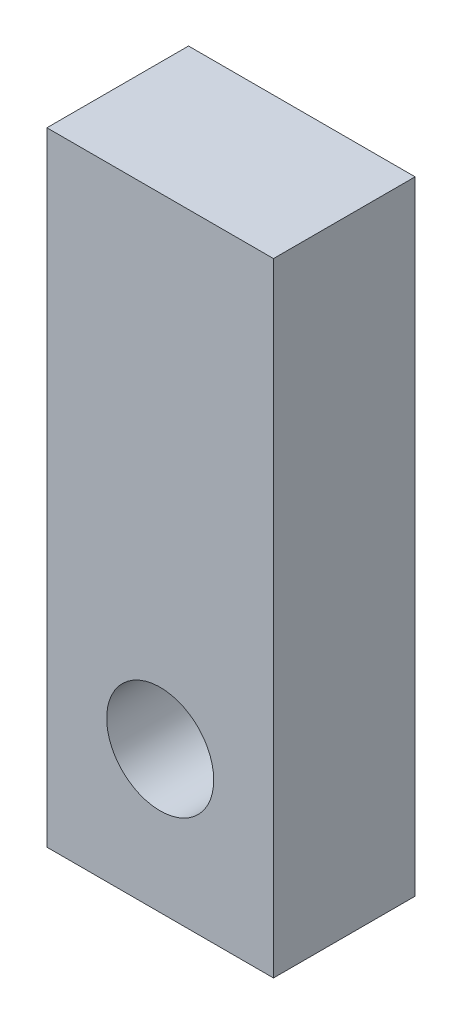
ISO-10303-21;
HEADER;
FILE_DESCRIPTION(('STEP AP214'),'2;1');
FILE_NAME('part.step','',(''),(''),'','','');
FILE_SCHEMA(('AUTOMOTIVE_DESIGN { 1 0 10303 214 1 1 1 1 }'));
ENDSEC;
DATA;
#1=APPLICATION_CONTEXT('core data for automotive mechanical design processes');
#2=APPLICATION_PROTOCOL_DEFINITION('international standard','automotive_design',2000,#1);
#3=PRODUCT_CONTEXT('',#1,'mechanical');
#4=PRODUCT('Part','Part','',(#3));
#5=PRODUCT_RELATED_PRODUCT_CATEGORY('part','',(#4));
#6=PRODUCT_DEFINITION_FORMATION('','',#4);
#7=PRODUCT_DEFINITION_CONTEXT('part definition',#1,'design');
#8=PRODUCT_DEFINITION('design','',#6,#7);
#9=PRODUCT_DEFINITION_SHAPE('','',#8);
#10=(LENGTH_UNIT() NAMED_UNIT(*) SI_UNIT(.MILLI.,.METRE.));
#11=(NAMED_UNIT(*) PLANE_ANGLE_UNIT() SI_UNIT($,.RADIAN.));
#12=(NAMED_UNIT(*) SI_UNIT($,.STERADIAN.) SOLID_ANGLE_UNIT());
#13=UNCERTAINTY_MEASURE_WITH_UNIT(LENGTH_MEASURE(1.E-05),#10,'distance_accuracy_value','');
#14=(GEOMETRIC_REPRESENTATION_CONTEXT(3) GLOBAL_UNCERTAINTY_ASSIGNED_CONTEXT((#13)) GLOBAL_UNIT_ASSIGNED_CONTEXT((#10,
#11,#12)) REPRESENTATION_CONTEXT('',''));
#15=CARTESIAN_POINT('',(0.,0.,0.));
#16=DIRECTION('',(0.,0.,1.));
#17=DIRECTION('',(1.,0.,0.));
#18=AXIS2_PLACEMENT_3D('',#15,#16,#17);
#19=CARTESIAN_POINT('',(-4.,-5.,5.));
#20=DIRECTION('',(1.,0.,0.));
#21=DIRECTION('',(0.,0.,-1.));
#22=AXIS2_PLACEMENT_3D('',#19,#20,#21);
#23=PLANE('',#22);
#24=DIRECTION('',(0.,-1.,0.));
#25=VECTOR('',#24,1.);
#26=CARTESIAN_POINT('',(-4.,-5.,0.));
#27=LINE('',#26,#25);
#28=CARTESIAN_POINT('',(-4.,17.,0.));
#29=VERTEX_POINT('',#28);
#30=CARTESIAN_POINT('',(-4.,-5.,0.));
#31=VERTEX_POINT('',#30);
#32=EDGE_CURVE('E99',#29,#31,#27,.T.);
#33=ORIENTED_EDGE('',*,*,#32,.T.);
#34=DIRECTION('',(0.,0.,-1.));
#35=VECTOR('',#34,1.);
#36=CARTESIAN_POINT('',(-4.,-5.,5.));
#37=LINE('',#36,#35);
#38=CARTESIAN_POINT('',(-4.,-5.,5.));
#39=VERTEX_POINT('',#38);
#40=EDGE_CURVE('E11',#39,#31,#37,.T.);
#41=ORIENTED_EDGE('',*,*,#40,.F.);
#42=DIRECTION('',(0.,-1.,0.));
#43=VECTOR('',#42,1.);
#44=CARTESIAN_POINT('',(-4.,-5.,5.));
#45=LINE('',#44,#43);
#46=CARTESIAN_POINT('',(-4.,17.,5.));
#47=VERTEX_POINT('',#46);
#48=EDGE_CURVE('E87',#47,#39,#45,.T.);
#49=ORIENTED_EDGE('',*,*,#48,.F.);
#50=DIRECTION('',(0.,0.,-1.));
#51=VECTOR('',#50,1.);
#52=CARTESIAN_POINT('',(-4.,17.,5.));
#53=LINE('',#52,#51);
#54=EDGE_CURVE('E95',#47,#29,#53,.T.);
#55=ORIENTED_EDGE('',*,*,#54,.T.);
#56=EDGE_LOOP('',(#33,#41,#49,#55));
#57=FACE_BOUND('',#56,.T.);
#58=ADVANCED_FACE('F36',(#57),#23,.F.);
#59=CARTESIAN_POINT('',(-4.,-5.,5.));
#60=DIRECTION('',(0.,1.,0.));
#61=DIRECTION('',(0.,0.,1.));
#62=AXIS2_PLACEMENT_3D('',#59,#60,#61);
#63=PLANE('',#62);
#64=DIRECTION('',(1.,0.,0.));
#65=VECTOR('',#64,1.);
#66=CARTESIAN_POINT('',(-4.,-5.,0.));
#67=LINE('',#66,#65);
#68=CARTESIAN_POINT('',(4.,-5.,0.));
#69=VERTEX_POINT('',#68);
#70=EDGE_CURVE('E91',#31,#69,#67,.T.);
#71=ORIENTED_EDGE('',*,*,#70,.T.);
#72=DIRECTION('',(0.,0.,-1.));
#73=VECTOR('',#72,1.);
#74=CARTESIAN_POINT('',(4.,-5.,5.));
#75=LINE('',#74,#73);
#76=CARTESIAN_POINT('',(4.,-5.,5.));
#77=VERTEX_POINT('',#76);
#78=EDGE_CURVE('E44',#77,#69,#75,.T.);
#79=ORIENTED_EDGE('',*,*,#78,.F.);
#80=DIRECTION('',(1.,0.,0.));
#81=VECTOR('',#80,1.);
#82=CARTESIAN_POINT('',(-4.,-5.,5.));
#83=LINE('',#82,#81);
#84=EDGE_CURVE('E82',#39,#77,#83,.T.);
#85=ORIENTED_EDGE('',*,*,#84,.F.);
#86=ORIENTED_EDGE('',*,*,#40,.T.);
#87=EDGE_LOOP('',(#71,#79,#85,#86));
#88=FACE_BOUND('',#87,.T.);
#89=ADVANCED_FACE('F90',(#88),#63,.F.);
#90=CARTESIAN_POINT('',(4.,-5.,5.));
#91=DIRECTION('',(-1.,0.,0.));
#92=DIRECTION('',(0.,0.,1.));
#93=AXIS2_PLACEMENT_3D('',#90,#91,#92);
#94=PLANE('',#93);
#95=DIRECTION('',(0.,1.,0.));
#96=VECTOR('',#95,1.);
#97=CARTESIAN_POINT('',(4.,-5.,0.));
#98=LINE('',#97,#96);
#99=CARTESIAN_POINT('',(4.,17.,0.));
#100=VERTEX_POINT('',#99);
#101=EDGE_CURVE('E69',#69,#100,#98,.T.);
#102=ORIENTED_EDGE('',*,*,#101,.T.);
#103=DIRECTION('',(0.,0.,-1.));
#104=VECTOR('',#103,1.);
#105=CARTESIAN_POINT('',(4.,17.,5.));
#106=LINE('',#105,#104);
#107=CARTESIAN_POINT('',(4.,17.,5.));
#108=VERTEX_POINT('',#107);
#109=EDGE_CURVE('E92',#108,#100,#106,.T.);
#110=ORIENTED_EDGE('',*,*,#109,.F.);
#111=DIRECTION('',(0.,1.,0.));
#112=VECTOR('',#111,1.);
#113=CARTESIAN_POINT('',(4.,-5.,5.));
#114=LINE('',#113,#112);
#115=EDGE_CURVE('E85',#77,#108,#114,.T.);
#116=ORIENTED_EDGE('',*,*,#115,.F.);
#117=ORIENTED_EDGE('',*,*,#78,.T.);
#118=EDGE_LOOP('',(#102,#110,#116,#117));
#119=FACE_BOUND('',#118,.T.);
#120=ADVANCED_FACE('F93',(#119),#94,.F.);
#121=CARTESIAN_POINT('',(-4.,17.,5.));
#122=DIRECTION('',(0.,-1.,0.));
#123=DIRECTION('',(0.,0.,-1.));
#124=AXIS2_PLACEMENT_3D('',#121,#122,#123);
#125=PLANE('',#124);
#126=DIRECTION('',(-1.,0.,0.));
#127=VECTOR('',#126,1.);
#128=CARTESIAN_POINT('',(-4.,17.,0.));
#129=LINE('',#128,#127);
#130=EDGE_CURVE('E75',#100,#29,#129,.T.);
#131=ORIENTED_EDGE('',*,*,#130,.T.);
#132=ORIENTED_EDGE('',*,*,#54,.F.);
#133=DIRECTION('',(-1.,0.,0.));
#134=VECTOR('',#133,1.);
#135=CARTESIAN_POINT('',(-4.,17.,5.));
#136=LINE('',#135,#134);
#137=EDGE_CURVE('E52',#108,#47,#136,.T.);
#138=ORIENTED_EDGE('',*,*,#137,.F.);
#139=ORIENTED_EDGE('',*,*,#109,.T.);
#140=EDGE_LOOP('',(#131,#132,#138,#139));
#141=FACE_BOUND('',#140,.T.);
#142=ADVANCED_FACE('F107',(#141),#125,.F.);
#143=CARTESIAN_POINT('',(0.,0.,5.));
#144=DIRECTION('',(0.,0.,-1.));
#145=DIRECTION('',(-1.,0.,0.));
#146=AXIS2_PLACEMENT_3D('',#143,#144,#145);
#147=PLANE('',#146);
#148=CARTESIAN_POINT('',(0.,0.,5.));
#149=DIRECTION('',(0.,0.,1.));
#150=DIRECTION('',(1.,0.,0.));
#151=AXIS2_PLACEMENT_3D('',#148,#149,#150);
#152=CIRCLE('',#151,1.88999999999999);
#153=CARTESIAN_POINT('',(1.88999999999999,0.,5.));
#154=VERTEX_POINT('',#153);
#155=EDGE_CURVE('E115',#154,#154,#152,.T.);
#156=ORIENTED_EDGE('',*,*,#155,.F.);
#157=EDGE_LOOP('',(#156));
#158=FACE_BOUND('',#157,.T.);
#159=ORIENTED_EDGE('',*,*,#48,.T.);
#160=ORIENTED_EDGE('',*,*,#84,.T.);
#161=ORIENTED_EDGE('',*,*,#115,.T.);
#162=ORIENTED_EDGE('',*,*,#137,.T.);
#163=EDGE_LOOP('',(#159,#160,#161,#162));
#164=FACE_BOUND('',#163,.T.);
#165=ADVANCED_FACE('F83',(#158,#164),#147,.F.);
#166=CARTESIAN_POINT('',(0.,0.,0.));
#167=DIRECTION('',(0.,0.,-1.));
#168=DIRECTION('',(-1.,0.,0.));
#169=AXIS2_PLACEMENT_3D('',#166,#167,#168);
#170=PLANE('',#169);
#171=CARTESIAN_POINT('',(0.,0.,0.));
#172=DIRECTION('',(0.,0.,1.));
#173=DIRECTION('',(1.,0.,0.));
#174=AXIS2_PLACEMENT_3D('',#171,#172,#173);
#175=CIRCLE('',#174,1.88999999999999);
#176=CARTESIAN_POINT('',(1.88999999999999,0.,0.));
#177=VERTEX_POINT('',#176);
#178=EDGE_CURVE('E102',#177,#177,#175,.T.);
#179=ORIENTED_EDGE('',*,*,#178,.T.);
#180=EDGE_LOOP('',(#179));
#181=FACE_BOUND('',#180,.T.);
#182=ORIENTED_EDGE('',*,*,#32,.F.);
#183=ORIENTED_EDGE('',*,*,#130,.F.);
#184=ORIENTED_EDGE('',*,*,#101,.F.);
#185=ORIENTED_EDGE('',*,*,#70,.F.);
#186=EDGE_LOOP('',(#182,#183,#184,#185));
#187=FACE_BOUND('',#186,.T.);
#188=ADVANCED_FACE('F110',(#181,#187),#170,.T.);
#189=CARTESIAN_POINT('',(0.,0.,5.));
#190=DIRECTION('',(0.,0.,1.));
#191=DIRECTION('',(1.,0.,0.));
#192=AXIS2_PLACEMENT_3D('',#189,#190,#191);
#193=CYLINDRICAL_SURFACE('',#192,1.88999999999999);
#194=ORIENTED_EDGE('',*,*,#178,.F.);
#195=EDGE_LOOP('',(#194));
#196=FACE_BOUND('',#195,.T.);
#197=ORIENTED_EDGE('',*,*,#155,.T.);
#198=EDGE_LOOP('',(#197));
#199=FACE_BOUND('',#198,.T.);
#200=ADVANCED_FACE('F119',(#196,#199),#193,.F.);
#201=CLOSED_SHELL('',(#58,#89,#120,#142,#165,#188,#200));
#202=MANIFOLD_SOLID_BREP('B2',#201);
#203=ADVANCED_BREP_SHAPE_REPRESENTATION('',(#18,#202),#14);
#204=SHAPE_DEFINITION_REPRESENTATION(#9,#203);
ENDSEC;
END-ISO-10303-21;
